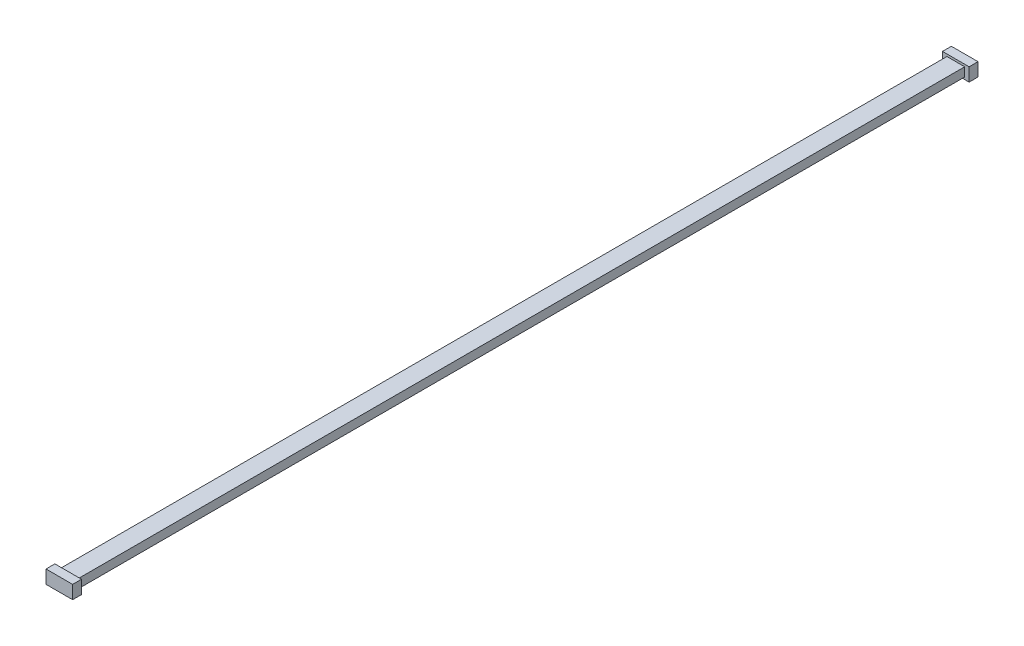
ISO-10303-21;
HEADER;
FILE_DESCRIPTION(('STEP AP214'),'2;1');
FILE_NAME('part.step','',(''),(''),'','','');
FILE_SCHEMA(('AUTOMOTIVE_DESIGN { 1 0 10303 214 1 1 1 1 }'));
ENDSEC;
DATA;
#1=APPLICATION_CONTEXT('core data for automotive mechanical design processes');
#2=APPLICATION_PROTOCOL_DEFINITION('international standard','automotive_design',2000,#1);
#3=PRODUCT_CONTEXT('',#1,'mechanical');
#4=PRODUCT('Part','Part','',(#3));
#5=PRODUCT_RELATED_PRODUCT_CATEGORY('part','',(#4));
#6=PRODUCT_DEFINITION_FORMATION('','',#4);
#7=PRODUCT_DEFINITION_CONTEXT('part definition',#1,'design');
#8=PRODUCT_DEFINITION('design','',#6,#7);
#9=PRODUCT_DEFINITION_SHAPE('','',#8);
#10=(LENGTH_UNIT() NAMED_UNIT(*) SI_UNIT(.MILLI.,.METRE.));
#11=(NAMED_UNIT(*) PLANE_ANGLE_UNIT() SI_UNIT($,.RADIAN.));
#12=(NAMED_UNIT(*) SI_UNIT($,.STERADIAN.) SOLID_ANGLE_UNIT());
#13=UNCERTAINTY_MEASURE_WITH_UNIT(LENGTH_MEASURE(1.E-05),#10,'distance_accuracy_value','');
#14=(GEOMETRIC_REPRESENTATION_CONTEXT(3) GLOBAL_UNCERTAINTY_ASSIGNED_CONTEXT((#13)) GLOBAL_UNIT_ASSIGNED_CONTEXT((#10,
#11,#12)) REPRESENTATION_CONTEXT('',''));
#15=CARTESIAN_POINT('',(0.,0.,0.));
#16=DIRECTION('',(0.,0.,1.));
#17=DIRECTION('',(1.,0.,0.));
#18=AXIS2_PLACEMENT_3D('',#15,#16,#17);
#19=CARTESIAN_POINT('',(10.,5.,500.));
#20=DIRECTION('',(-1.,0.,0.));
#21=DIRECTION('',(0.,0.,1.));
#22=AXIS2_PLACEMENT_3D('',#19,#20,#21);
#23=PLANE('',#22);
#24=DIRECTION('',(0.,0.,-1.));
#25=VECTOR('',#24,1.);
#26=CARTESIAN_POINT('',(10.,-5.,500.));
#27=LINE('',#26,#25);
#28=CARTESIAN_POINT('',(10.,-5.,500.));
#29=VERTEX_POINT('',#28);
#30=CARTESIAN_POINT('',(10.,-5.,-500.));
#31=VERTEX_POINT('',#30);
#32=EDGE_CURVE('E216',#29,#31,#27,.T.);
#33=ORIENTED_EDGE('',*,*,#32,.T.);
#34=DIRECTION('',(0.,1.,0.));
#35=VECTOR('',#34,1.);
#36=CARTESIAN_POINT('',(10.,5.,-500.));
#37=LINE('',#36,#35);
#38=CARTESIAN_POINT('',(10.,5.,-500.));
#39=VERTEX_POINT('',#38);
#40=EDGE_CURVE('E133',#31,#39,#37,.T.);
#41=ORIENTED_EDGE('',*,*,#40,.T.);
#42=DIRECTION('',(0.,0.,-1.));
#43=VECTOR('',#42,1.);
#44=CARTESIAN_POINT('',(10.,5.,500.));
#45=LINE('',#44,#43);
#46=CARTESIAN_POINT('',(10.,5.,500.));
#47=VERTEX_POINT('',#46);
#48=EDGE_CURVE('E11',#47,#39,#45,.T.);
#49=ORIENTED_EDGE('',*,*,#48,.F.);
#50=DIRECTION('',(0.,1.,0.));
#51=VECTOR('',#50,1.);
#52=CARTESIAN_POINT('',(10.,5.,500.));
#53=LINE('',#52,#51);
#54=EDGE_CURVE('E204',#29,#47,#53,.T.);
#55=ORIENTED_EDGE('',*,*,#54,.F.);
#56=EDGE_LOOP('',(#33,#41,#49,#55));
#57=FACE_BOUND('',#56,.T.);
#58=ADVANCED_FACE('F33',(#57),#23,.F.);
#59=CARTESIAN_POINT('',(-10.,5.,500.));
#60=DIRECTION('',(0.,-1.,0.));
#61=DIRECTION('',(0.,0.,-1.));
#62=AXIS2_PLACEMENT_3D('',#59,#60,#61);
#63=PLANE('',#62);
#64=ORIENTED_EDGE('',*,*,#48,.T.);
#65=DIRECTION('',(-1.,0.,0.));
#66=VECTOR('',#65,1.);
#67=CARTESIAN_POINT('',(-10.,5.,-500.));
#68=LINE('',#67,#66);
#69=CARTESIAN_POINT('',(-10.,5.,-500.));
#70=VERTEX_POINT('',#69);
#71=EDGE_CURVE('E172',#39,#70,#68,.T.);
#72=ORIENTED_EDGE('',*,*,#71,.T.);
#73=DIRECTION('',(0.,0.,-1.));
#74=VECTOR('',#73,1.);
#75=CARTESIAN_POINT('',(-10.,5.,500.));
#76=LINE('',#75,#74);
#77=CARTESIAN_POINT('',(-10.,5.,500.));
#78=VERTEX_POINT('',#77);
#79=EDGE_CURVE('E40',#78,#70,#76,.T.);
#80=ORIENTED_EDGE('',*,*,#79,.F.);
#81=DIRECTION('',(-1.,0.,0.));
#82=VECTOR('',#81,1.);
#83=CARTESIAN_POINT('',(-10.,5.,500.));
#84=LINE('',#83,#82);
#85=EDGE_CURVE('E207',#47,#78,#84,.T.);
#86=ORIENTED_EDGE('',*,*,#85,.F.);
#87=EDGE_LOOP('',(#64,#72,#80,#86));
#88=FACE_BOUND('',#87,.T.);
#89=ADVANCED_FACE('F220',(#88),#63,.F.);
#90=CARTESIAN_POINT('',(-10.,5.,500.));
#91=DIRECTION('',(1.,0.,0.));
#92=DIRECTION('',(0.,1.,0.));
#93=AXIS2_PLACEMENT_3D('',#90,#91,#92);
#94=PLANE('',#93);
#95=ORIENTED_EDGE('',*,*,#79,.T.);
#96=DIRECTION('',(0.,-1.,0.));
#97=VECTOR('',#96,1.);
#98=CARTESIAN_POINT('',(-10.,5.,-500.));
#99=LINE('',#98,#97);
#100=CARTESIAN_POINT('',(-9.99999999999999,-5.,-500.));
#101=VERTEX_POINT('',#100);
#102=EDGE_CURVE('E170',#70,#101,#99,.T.);
#103=ORIENTED_EDGE('',*,*,#102,.T.);
#104=DIRECTION('',(0.,0.,-1.));
#105=VECTOR('',#104,1.);
#106=CARTESIAN_POINT('',(-9.99999999999999,-5.,500.));
#107=LINE('',#106,#105);
#108=CARTESIAN_POINT('',(-9.99999999999999,-5.,500.));
#109=VERTEX_POINT('',#108);
#110=EDGE_CURVE('E47',#109,#101,#107,.T.);
#111=ORIENTED_EDGE('',*,*,#110,.F.);
#112=DIRECTION('',(0.,-1.,0.));
#113=VECTOR('',#112,1.);
#114=CARTESIAN_POINT('',(-10.,5.,500.));
#115=LINE('',#114,#113);
#116=EDGE_CURVE('E210',#78,#109,#115,.T.);
#117=ORIENTED_EDGE('',*,*,#116,.F.);
#118=EDGE_LOOP('',(#95,#103,#111,#117));
#119=FACE_BOUND('',#118,.T.);
#120=ADVANCED_FACE('F219',(#119),#94,.F.);
#121=CARTESIAN_POINT('',(-9.99999999999999,-5.,500.));
#122=DIRECTION('',(0.,1.,0.));
#123=DIRECTION('',(0.,0.,1.));
#124=AXIS2_PLACEMENT_3D('',#121,#122,#123);
#125=PLANE('',#124);
#126=ORIENTED_EDGE('',*,*,#110,.T.);
#127=DIRECTION('',(1.,0.,0.));
#128=VECTOR('',#127,1.);
#129=CARTESIAN_POINT('',(-9.99999999999999,-5.,-500.));
#130=LINE('',#129,#128);
#131=EDGE_CURVE('E167',#101,#31,#130,.T.);
#132=ORIENTED_EDGE('',*,*,#131,.T.);
#133=ORIENTED_EDGE('',*,*,#32,.F.);
#134=DIRECTION('',(1.,0.,0.));
#135=VECTOR('',#134,1.);
#136=CARTESIAN_POINT('',(-9.99999999999999,-5.,500.));
#137=LINE('',#136,#135);
#138=EDGE_CURVE('E213',#109,#29,#137,.T.);
#139=ORIENTED_EDGE('',*,*,#138,.F.);
#140=EDGE_LOOP('',(#126,#132,#133,#139));
#141=FACE_BOUND('',#140,.T.);
#142=ADVANCED_FACE('F227',(#141),#125,.F.);
#143=CARTESIAN_POINT('',(0.,0.,500.));
#144=DIRECTION('',(0.,0.,1.));
#145=DIRECTION('',(1.,0.,0.));
#146=AXIS2_PLACEMENT_3D('',#143,#144,#145);
#147=PLANE('',#146);
#148=DIRECTION('',(0.,1.,0.));
#149=VECTOR('',#148,1.);
#150=CARTESIAN_POINT('',(15.,7.5,500.));
#151=LINE('',#150,#149);
#152=CARTESIAN_POINT('',(15.,-7.5,500.));
#153=VERTEX_POINT('',#152);
#154=CARTESIAN_POINT('',(15.,7.5,500.));
#155=VERTEX_POINT('',#154);
#156=EDGE_CURVE('E174',#153,#155,#151,.T.);
#157=ORIENTED_EDGE('',*,*,#156,.F.);
#158=DIRECTION('',(1.,0.,0.));
#159=VECTOR('',#158,1.);
#160=CARTESIAN_POINT('',(-15.,-7.5,500.));
#161=LINE('',#160,#159);
#162=CARTESIAN_POINT('',(-15.,-7.5,500.));
#163=VERTEX_POINT('',#162);
#164=EDGE_CURVE('E179',#163,#153,#161,.T.);
#165=ORIENTED_EDGE('',*,*,#164,.F.);
#166=DIRECTION('',(0.,-1.,0.));
#167=VECTOR('',#166,1.);
#168=CARTESIAN_POINT('',(-15.,7.5,500.));
#169=LINE('',#168,#167);
#170=CARTESIAN_POINT('',(-15.,7.5,500.));
#171=VERTEX_POINT('',#170);
#172=EDGE_CURVE('E190',#171,#163,#169,.T.);
#173=ORIENTED_EDGE('',*,*,#172,.F.);
#174=DIRECTION('',(-1.,0.,0.));
#175=VECTOR('',#174,1.);
#176=CARTESIAN_POINT('',(-15.,7.5,500.));
#177=LINE('',#176,#175);
#178=EDGE_CURVE('E188',#155,#171,#177,.T.);
#179=ORIENTED_EDGE('',*,*,#178,.F.);
#180=EDGE_LOOP('',(#157,#165,#173,#179));
#181=FACE_BOUND('',#180,.T.);
#182=ORIENTED_EDGE('',*,*,#138,.T.);
#183=ORIENTED_EDGE('',*,*,#54,.T.);
#184=ORIENTED_EDGE('',*,*,#85,.T.);
#185=ORIENTED_EDGE('',*,*,#116,.T.);
#186=EDGE_LOOP('',(#182,#183,#184,#185));
#187=FACE_BOUND('',#186,.T.);
#188=ADVANCED_FACE('F229',(#181,#187),#147,.F.);
#189=CARTESIAN_POINT('',(15.,7.5,510.));
#190=DIRECTION('',(-1.,0.,0.));
#191=DIRECTION('',(0.,0.,1.));
#192=AXIS2_PLACEMENT_3D('',#189,#190,#191);
#193=PLANE('',#192);
#194=ORIENTED_EDGE('',*,*,#156,.T.);
#195=DIRECTION('',(0.,0.,-1.));
#196=VECTOR('',#195,1.);
#197=CARTESIAN_POINT('',(15.,7.5,510.));
#198=LINE('',#197,#196);
#199=CARTESIAN_POINT('',(15.,7.5,510.));
#200=VERTEX_POINT('',#199);
#201=EDGE_CURVE('E201',#200,#155,#198,.T.);
#202=ORIENTED_EDGE('',*,*,#201,.F.);
#203=DIRECTION('',(0.,1.,0.));
#204=VECTOR('',#203,1.);
#205=CARTESIAN_POINT('',(15.,7.5,510.));
#206=LINE('',#205,#204);
#207=CARTESIAN_POINT('',(15.,-7.5,510.));
#208=VERTEX_POINT('',#207);
#209=EDGE_CURVE('E175',#208,#200,#206,.T.);
#210=ORIENTED_EDGE('',*,*,#209,.F.);
#211=DIRECTION('',(0.,0.,-1.));
#212=VECTOR('',#211,1.);
#213=CARTESIAN_POINT('',(15.,-7.5,510.));
#214=LINE('',#213,#212);
#215=EDGE_CURVE('E185',#208,#153,#214,.T.);
#216=ORIENTED_EDGE('',*,*,#215,.T.);
#217=EDGE_LOOP('',(#194,#202,#210,#216));
#218=FACE_BOUND('',#217,.T.);
#219=ADVANCED_FACE('F242',(#218),#193,.F.);
#220=CARTESIAN_POINT('',(-15.,7.5,510.));
#221=DIRECTION('',(0.,-1.,0.));
#222=DIRECTION('',(0.,0.,-1.));
#223=AXIS2_PLACEMENT_3D('',#220,#221,#222);
#224=PLANE('',#223);
#225=ORIENTED_EDGE('',*,*,#178,.T.);
#226=DIRECTION('',(0.,0.,-1.));
#227=VECTOR('',#226,1.);
#228=CARTESIAN_POINT('',(-15.,7.5,510.));
#229=LINE('',#228,#227);
#230=CARTESIAN_POINT('',(-15.,7.5,510.));
#231=VERTEX_POINT('',#230);
#232=EDGE_CURVE('E198',#231,#171,#229,.T.);
#233=ORIENTED_EDGE('',*,*,#232,.F.);
#234=DIRECTION('',(-1.,0.,0.));
#235=VECTOR('',#234,1.);
#236=CARTESIAN_POINT('',(-15.,7.5,510.));
#237=LINE('',#236,#235);
#238=EDGE_CURVE('E178',#200,#231,#237,.T.);
#239=ORIENTED_EDGE('',*,*,#238,.F.);
#240=ORIENTED_EDGE('',*,*,#201,.T.);
#241=EDGE_LOOP('',(#225,#233,#239,#240));
#242=FACE_BOUND('',#241,.T.);
#243=ADVANCED_FACE('F245',(#242),#224,.F.);
#244=CARTESIAN_POINT('',(-15.,7.5,510.));
#245=DIRECTION('',(1.,0.,0.));
#246=DIRECTION('',(0.,1.,0.));
#247=AXIS2_PLACEMENT_3D('',#244,#245,#246);
#248=PLANE('',#247);
#249=ORIENTED_EDGE('',*,*,#172,.T.);
#250=DIRECTION('',(0.,0.,-1.));
#251=VECTOR('',#250,1.);
#252=CARTESIAN_POINT('',(-15.,-7.5,510.));
#253=LINE('',#252,#251);
#254=CARTESIAN_POINT('',(-15.,-7.5,510.));
#255=VERTEX_POINT('',#254);
#256=EDGE_CURVE('E195',#255,#163,#253,.T.);
#257=ORIENTED_EDGE('',*,*,#256,.F.);
#258=DIRECTION('',(0.,-1.,0.));
#259=VECTOR('',#258,1.);
#260=CARTESIAN_POINT('',(-15.,7.5,510.));
#261=LINE('',#260,#259);
#262=EDGE_CURVE('E181',#231,#255,#261,.T.);
#263=ORIENTED_EDGE('',*,*,#262,.F.);
#264=ORIENTED_EDGE('',*,*,#232,.T.);
#265=EDGE_LOOP('',(#249,#257,#263,#264));
#266=FACE_BOUND('',#265,.T.);
#267=ADVANCED_FACE('F249',(#266),#248,.F.);
#268=CARTESIAN_POINT('',(-15.,-7.5,510.));
#269=DIRECTION('',(0.,1.,0.));
#270=DIRECTION('',(0.,0.,1.));
#271=AXIS2_PLACEMENT_3D('',#268,#269,#270);
#272=PLANE('',#271);
#273=ORIENTED_EDGE('',*,*,#164,.T.);
#274=ORIENTED_EDGE('',*,*,#215,.F.);
#275=DIRECTION('',(1.,0.,0.));
#276=VECTOR('',#275,1.);
#277=CARTESIAN_POINT('',(-15.,-7.5,510.));
#278=LINE('',#277,#276);
#279=EDGE_CURVE('E183',#255,#208,#278,.T.);
#280=ORIENTED_EDGE('',*,*,#279,.F.);
#281=ORIENTED_EDGE('',*,*,#256,.T.);
#282=EDGE_LOOP('',(#273,#274,#280,#281));
#283=FACE_BOUND('',#282,.T.);
#284=ADVANCED_FACE('F253',(#283),#272,.F.);
#285=CARTESIAN_POINT('',(0.,0.,510.));
#286=DIRECTION('',(0.,0.,1.));
#287=DIRECTION('',(1.,0.,0.));
#288=AXIS2_PLACEMENT_3D('',#285,#286,#287);
#289=PLANE('',#288);
#290=ORIENTED_EDGE('',*,*,#209,.T.);
#291=ORIENTED_EDGE('',*,*,#238,.T.);
#292=ORIENTED_EDGE('',*,*,#262,.T.);
#293=ORIENTED_EDGE('',*,*,#279,.T.);
#294=EDGE_LOOP('',(#290,#291,#292,#293));
#295=FACE_BOUND('',#294,.T.);
#296=ADVANCED_FACE('F257',(#295),#289,.T.);
#297=CARTESIAN_POINT('',(15.,7.5,-510.));
#298=DIRECTION('',(1.,0.,0.));
#299=DIRECTION('',(0.,0.,-1.));
#300=AXIS2_PLACEMENT_3D('',#297,#298,#299);
#301=PLANE('',#300);
#302=DIRECTION('',(0.,1.,0.));
#303=VECTOR('',#302,1.);
#304=CARTESIAN_POINT('',(15.,7.5,-500.));
#305=LINE('',#304,#303);
#306=CARTESIAN_POINT('',(15.,-7.5,-500.));
#307=VERTEX_POINT('',#306);
#308=CARTESIAN_POINT('',(15.,7.5,-500.));
#309=VERTEX_POINT('',#308);
#310=EDGE_CURVE('E128',#307,#309,#305,.T.);
#311=ORIENTED_EDGE('',*,*,#310,.F.);
#312=DIRECTION('',(0.,0.,1.));
#313=VECTOR('',#312,1.);
#314=CARTESIAN_POINT('',(15.,-7.5,-510.));
#315=LINE('',#314,#313);
#316=CARTESIAN_POINT('',(15.,-7.5,-510.));
#317=VERTEX_POINT('',#316);
#318=EDGE_CURVE('E122',#317,#307,#315,.T.);
#319=ORIENTED_EDGE('',*,*,#318,.F.);
#320=DIRECTION('',(0.,1.,0.));
#321=VECTOR('',#320,1.);
#322=CARTESIAN_POINT('',(15.,7.5,-510.));
#323=LINE('',#322,#321);
#324=CARTESIAN_POINT('',(15.,7.5,-510.));
#325=VERTEX_POINT('',#324);
#326=EDGE_CURVE('E125',#317,#325,#323,.T.);
#327=ORIENTED_EDGE('',*,*,#326,.T.);
#328=DIRECTION('',(0.,0.,1.));
#329=VECTOR('',#328,1.);
#330=CARTESIAN_POINT('',(15.,7.5,-510.));
#331=LINE('',#330,#329);
#332=EDGE_CURVE('E152',#325,#309,#331,.T.);
#333=ORIENTED_EDGE('',*,*,#332,.T.);
#334=EDGE_LOOP('',(#311,#319,#327,#333));
#335=FACE_BOUND('',#334,.T.);
#336=ADVANCED_FACE('F124',(#335),#301,.T.);
#337=CARTESIAN_POINT('',(-15.,-7.5,-510.));
#338=DIRECTION('',(0.,-1.,0.));
#339=DIRECTION('',(0.,0.,-1.));
#340=AXIS2_PLACEMENT_3D('',#337,#338,#339);
#341=PLANE('',#340);
#342=DIRECTION('',(1.,0.,0.));
#343=VECTOR('',#342,1.);
#344=CARTESIAN_POINT('',(-15.,-7.5,-500.));
#345=LINE('',#344,#343);
#346=CARTESIAN_POINT('',(-15.,-7.5,-500.));
#347=VERTEX_POINT('',#346);
#348=EDGE_CURVE('E154',#347,#307,#345,.T.);
#349=ORIENTED_EDGE('',*,*,#348,.F.);
#350=DIRECTION('',(0.,0.,1.));
#351=VECTOR('',#350,1.);
#352=CARTESIAN_POINT('',(-15.,-7.5,-510.));
#353=LINE('',#352,#351);
#354=CARTESIAN_POINT('',(-15.,-7.5,-510.));
#355=VERTEX_POINT('',#354);
#356=EDGE_CURVE('E134',#355,#347,#353,.T.);
#357=ORIENTED_EDGE('',*,*,#356,.F.);
#358=DIRECTION('',(1.,0.,0.));
#359=VECTOR('',#358,1.);
#360=CARTESIAN_POINT('',(-15.,-7.5,-510.));
#361=LINE('',#360,#359);
#362=EDGE_CURVE('E140',#355,#317,#361,.T.);
#363=ORIENTED_EDGE('',*,*,#362,.T.);
#364=ORIENTED_EDGE('',*,*,#318,.T.);
#365=EDGE_LOOP('',(#349,#357,#363,#364));
#366=FACE_BOUND('',#365,.T.);
#367=ADVANCED_FACE('F146',(#366),#341,.T.);
#368=CARTESIAN_POINT('',(-15.,7.5,-510.));
#369=DIRECTION('',(-1.,0.,0.));
#370=DIRECTION('',(0.,-1.,0.));
#371=AXIS2_PLACEMENT_3D('',#368,#369,#370);
#372=PLANE('',#371);
#373=DIRECTION('',(0.,-1.,0.));
#374=VECTOR('',#373,1.);
#375=CARTESIAN_POINT('',(-15.,7.5,-500.));
#376=LINE('',#375,#374);
#377=CARTESIAN_POINT('',(-15.,7.5,-500.));
#378=VERTEX_POINT('',#377);
#379=EDGE_CURVE('E156',#378,#347,#376,.T.);
#380=ORIENTED_EDGE('',*,*,#379,.F.);
#381=DIRECTION('',(0.,0.,1.));
#382=VECTOR('',#381,1.);
#383=CARTESIAN_POINT('',(-15.,7.5,-510.));
#384=LINE('',#383,#382);
#385=CARTESIAN_POINT('',(-15.,7.5,-510.));
#386=VERTEX_POINT('',#385);
#387=EDGE_CURVE('E162',#386,#378,#384,.T.);
#388=ORIENTED_EDGE('',*,*,#387,.F.);
#389=DIRECTION('',(0.,-1.,0.));
#390=VECTOR('',#389,1.);
#391=CARTESIAN_POINT('',(-15.,7.5,-510.));
#392=LINE('',#391,#390);
#393=EDGE_CURVE('E147',#386,#355,#392,.T.);
#394=ORIENTED_EDGE('',*,*,#393,.T.);
#395=ORIENTED_EDGE('',*,*,#356,.T.);
#396=EDGE_LOOP('',(#380,#388,#394,#395));
#397=FACE_BOUND('',#396,.T.);
#398=ADVANCED_FACE('F269',(#397),#372,.T.);
#399=CARTESIAN_POINT('',(-15.,7.5,-510.));
#400=DIRECTION('',(0.,1.,0.));
#401=DIRECTION('',(0.,0.,1.));
#402=AXIS2_PLACEMENT_3D('',#399,#400,#401);
#403=PLANE('',#402);
#404=DIRECTION('',(-1.,0.,0.));
#405=VECTOR('',#404,1.);
#406=CARTESIAN_POINT('',(-15.,7.5,-500.));
#407=LINE('',#406,#405);
#408=EDGE_CURVE('E144',#309,#378,#407,.T.);
#409=ORIENTED_EDGE('',*,*,#408,.F.);
#410=ORIENTED_EDGE('',*,*,#332,.F.);
#411=DIRECTION('',(-1.,0.,0.));
#412=VECTOR('',#411,1.);
#413=CARTESIAN_POINT('',(-15.,7.5,-510.));
#414=LINE('',#413,#412);
#415=EDGE_CURVE('E143',#325,#386,#414,.T.);
#416=ORIENTED_EDGE('',*,*,#415,.T.);
#417=ORIENTED_EDGE('',*,*,#387,.T.);
#418=EDGE_LOOP('',(#409,#410,#416,#417));
#419=FACE_BOUND('',#418,.T.);
#420=ADVANCED_FACE('F272',(#419),#403,.T.);
#421=CARTESIAN_POINT('',(0.,0.,-510.));
#422=DIRECTION('',(0.,0.,-1.));
#423=DIRECTION('',(1.,0.,0.));
#424=AXIS2_PLACEMENT_3D('',#421,#422,#423);
#425=PLANE('',#424);
#426=ORIENTED_EDGE('',*,*,#326,.F.);
#427=ORIENTED_EDGE('',*,*,#362,.F.);
#428=ORIENTED_EDGE('',*,*,#393,.F.);
#429=ORIENTED_EDGE('',*,*,#415,.F.);
#430=EDGE_LOOP('',(#426,#427,#428,#429));
#431=FACE_BOUND('',#430,.T.);
#432=ADVANCED_FACE('F138',(#431),#425,.T.);
#433=CARTESIAN_POINT('',(0.,0.,-500.));
#434=DIRECTION('',(0.,0.,-1.));
#435=DIRECTION('',(1.,0.,0.));
#436=AXIS2_PLACEMENT_3D('',#433,#434,#435);
#437=PLANE('',#436);
#438=ORIENTED_EDGE('',*,*,#40,.F.);
#439=ORIENTED_EDGE('',*,*,#131,.F.);
#440=ORIENTED_EDGE('',*,*,#102,.F.);
#441=ORIENTED_EDGE('',*,*,#71,.F.);
#442=EDGE_LOOP('',(#438,#439,#440,#441));
#443=FACE_BOUND('',#442,.T.);
#444=ORIENTED_EDGE('',*,*,#310,.T.);
#445=ORIENTED_EDGE('',*,*,#408,.T.);
#446=ORIENTED_EDGE('',*,*,#379,.T.);
#447=ORIENTED_EDGE('',*,*,#348,.T.);
#448=EDGE_LOOP('',(#444,#445,#446,#447));
#449=FACE_BOUND('',#448,.T.);
#450=ADVANCED_FACE('F223',(#443,#449),#437,.F.);
#451=CLOSED_SHELL('',(#58,#89,#120,#142,#188,#219,#243,#267,#284,#296,#336,#367,#398,#420,#432,#450));
#452=MANIFOLD_SOLID_BREP('B2',#451);
#453=ADVANCED_BREP_SHAPE_REPRESENTATION('',(#18,#452),#14);
#454=SHAPE_DEFINITION_REPRESENTATION(#9,#453);
ENDSEC;
END-ISO-10303-21;
